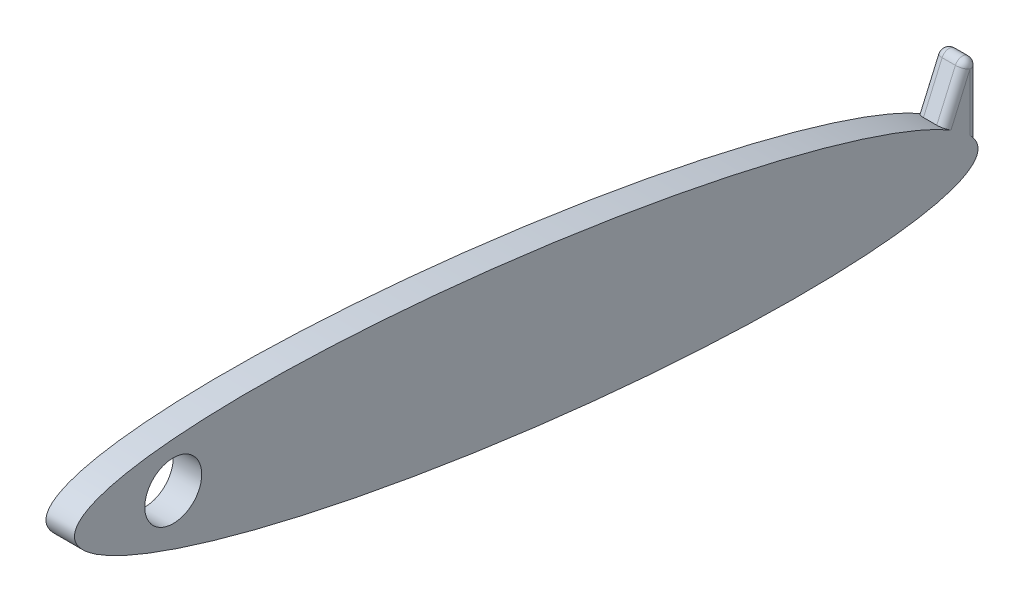
ISO-10303-21;
HEADER;
FILE_DESCRIPTION(('STEP AP214'),'2;1');
FILE_NAME('part.step','',(''),(''),'','','');
FILE_SCHEMA(('AUTOMOTIVE_DESIGN { 1 0 10303 214 1 1 1 1 }'));
ENDSEC;
DATA;
#1=APPLICATION_CONTEXT('core data for automotive mechanical design processes');
#2=APPLICATION_PROTOCOL_DEFINITION('international standard','automotive_design',2000,#1);
#3=PRODUCT_CONTEXT('',#1,'mechanical');
#4=PRODUCT('Part','Part','',(#3));
#5=PRODUCT_RELATED_PRODUCT_CATEGORY('part','',(#4));
#6=PRODUCT_DEFINITION_FORMATION('','',#4);
#7=PRODUCT_DEFINITION_CONTEXT('part definition',#1,'design');
#8=PRODUCT_DEFINITION('design','',#6,#7);
#9=PRODUCT_DEFINITION_SHAPE('','',#8);
#10=(LENGTH_UNIT() NAMED_UNIT(*) SI_UNIT(.MILLI.,.METRE.));
#11=(NAMED_UNIT(*) PLANE_ANGLE_UNIT() SI_UNIT($,.RADIAN.));
#12=(NAMED_UNIT(*) SI_UNIT($,.STERADIAN.) SOLID_ANGLE_UNIT());
#13=UNCERTAINTY_MEASURE_WITH_UNIT(LENGTH_MEASURE(1.E-05),#10,'distance_accuracy_value','');
#14=(GEOMETRIC_REPRESENTATION_CONTEXT(3) GLOBAL_UNCERTAINTY_ASSIGNED_CONTEXT((#13)) GLOBAL_UNIT_ASSIGNED_CONTEXT((#10,
#11,#12)) REPRESENTATION_CONTEXT('',''));
#15=CARTESIAN_POINT('',(0.,0.,0.));
#16=DIRECTION('',(0.,0.,1.));
#17=DIRECTION('',(1.,0.,0.));
#18=AXIS2_PLACEMENT_3D('',#15,#16,#17);
#19=CARTESIAN_POINT('',(4.7625,0.,0.));
#20=DIRECTION('',(1.,0.,0.));
#21=DIRECTION('',(0.,-0.130831963177534,-0.991404557893049));
#22=AXIS2_PLACEMENT_3D('',#19,#20,#21);
#23=ELLIPSE('',#22,76.2,12.7);
#24=DIRECTION('',(-1.,0.,0.));
#25=VECTOR('',#24,1.);
#26=SURFACE_OF_LINEAR_EXTRUSION('',#23,#25);
#27=DIRECTION('',(-1.,0.,0.));
#28=VECTOR('',#27,1.);
#29=CARTESIAN_POINT('',(4.7625,-4.11781313189924,-69.9342520410325));
#30=LINE('',#29,#28);
#31=CARTESIAN_POINT('',(1.27,-4.11781313189926,-69.9342520410325));
#32=VERTEX_POINT('',#31);
#33=CARTESIAN_POINT('',(3.4925,-4.11781313189926,-69.9342520410325));
#34=VERTEX_POINT('',#33);
#35=EDGE_CURVE('E11',#32,#34,#30,.F.);
#36=ORIENTED_EDGE('',*,*,#35,.F.);
#37=CARTESIAN_POINT('',(1.27,-4.11781313189925,-69.9342520410325));
#38=CARTESIAN_POINT('',(1.23437384321973,-4.11781321411353,-69.9342515505505));
#39=CARTESIAN_POINT('',(1.19876349745354,-4.11853075519739,-69.9355751404768));
#40=CARTESIAN_POINT('',(1.12779996880049,-4.12139459719955,-69.9408536288777));
#41=CARTESIAN_POINT('',(1.09244675926415,-4.12354074786129,-69.9448082506288));
#42=CARTESIAN_POINT('',(0.987218928975048,-4.13210341330859,-69.9605759609824));
#43=CARTESIAN_POINT('',(0.918053763795714,-4.14064419127636,-69.9762930214261));
#44=CARTESIAN_POINT('',(0.783681700420832,-4.16320979751784,-70.0176957443832));
#45=CARTESIAN_POINT('',(0.718476635138884,-4.17723714320999,-70.0433859828794));
#46=CARTESIAN_POINT('',(0.625110513491252,-4.20211184031202,-70.0887549558992));
#47=CARTESIAN_POINT('',(0.594725093332998,-4.21104374918917,-70.1050194166951));
#48=CARTESIAN_POINT('',(0.535590867132482,-4.23014462983823,-70.1397249628789));
#49=CARTESIAN_POINT('',(0.506843631821834,-4.24031476049458,-70.1581680868476));
#50=CARTESIAN_POINT('',(0.423389007095394,-4.27259619850998,-70.2165659302266));
#51=CARTESIAN_POINT('',(0.371457756242708,-4.29648146615738,-70.2595944556953));
#52=CARTESIAN_POINT('',(0.276572634470389,-4.34837938169682,-70.3525115707769));
#53=CARTESIAN_POINT('',(0.23361892834492,-4.37639210533743,-70.4024002862895));
#54=CARTESIAN_POINT('',(0.176742434507051,-4.42101549846716,-70.4813154887628));
#55=CARTESIAN_POINT('',(0.159008641523252,-4.43636468579517,-70.5083719775913));
#56=CARTESIAN_POINT('',(0.126225273314743,-4.46781265239265,-70.5636061722054));
#57=CARTESIAN_POINT('',(0.111173310233229,-4.48391074857391,-70.5917828529668));
#58=CARTESIAN_POINT('',(0.0701856415248406,-4.53320189839618,-70.6777276331635));
#59=CARTESIAN_POINT('',(0.0483834064666588,-4.56741910224701,-70.7369588322674));
#60=CARTESIAN_POINT('',(0.0216421648514737,-4.62620681335098,-70.8378730782814));
#61=CARTESIAN_POINT('',(0.0135287623225191,-4.65031350885898,-70.8790282691953));
#62=CARTESIAN_POINT('',(0.00270974934016672,-4.69900739488029,-70.9616806807105));
#63=CARTESIAN_POINT('',(-3.79310603027134E-06,-4.72359382696655,-71.0031773095898));
#64=CARTESIAN_POINT('',(0.,-4.74830563105564,-71.0446325196335));
#65=B_SPLINE_CURVE_WITH_KNOTS('',3,(#37,#38,#39,#40,#41,#42,#43,#44,#45,#46,#47,#48,#49,#50,#51,
#52,#53,#54,#55,#56,#57,#58,#59,#60,#61,#62,#63,#64),.UNSPECIFIED.,.F.,.F.,(4,2,2,2,2,2,2,2,2,2,
2,2,2,4),(0.,0.106815302436601,0.213619372158405,0.426865202597397,0.640208992261775,
0.746908362685685,0.85370837482254,1.06727132696658,1.28083819898389,1.38814673656577,
1.4953592456643,1.70959014910221,1.85445548150351,1.99910785996386),.UNSPECIFIED.);
#66=CARTESIAN_POINT('',(0.,-4.74830563105563,-71.0446325196335));
#67=VERTEX_POINT('',#66);
#68=EDGE_CURVE('E192',#32,#67,#65,.T.);
#69=ORIENTED_EDGE('',*,*,#68,.T.);
#70=CARTESIAN_POINT('',(0.,0.,0.));
#71=DIRECTION('',(1.,0.,0.));
#72=DIRECTION('',(0.,-0.130831963177534,-0.991404557893049));
#73=AXIS2_PLACEMENT_3D('',#70,#71,#72);
#74=ELLIPSE('',#73,76.2,12.7);
#75=CARTESIAN_POINT('',(0.,-7.10592023279893,-74.2122766697926));
#76=VERTEX_POINT('',#75);
#77=EDGE_CURVE('E262',#67,#76,#74,.T.);
#78=ORIENTED_EDGE('',*,*,#77,.T.);
#79=CARTESIAN_POINT('',(0.,-7.10592023279893,-74.2122766697926));
#80=CARTESIAN_POINT('',(7.50140419761714E-06,-7.15927373080229,-74.264980392285));
#81=CARTESIAN_POINT('',(0.00327929272487547,-7.21329875097445,-74.3169506709515));
#82=CARTESIAN_POINT('',(0.0158733544762433,-7.32240303932765,-74.4189362825912));
#83=CARTESIAN_POINT('',(0.0251908264463283,-7.37748143782267,-74.468953132652));
#84=CARTESIAN_POINT('',(0.0494139825498373,-7.48855471286345,-74.5666865783012));
#85=CARTESIAN_POINT('',(0.0643262641561636,-7.54455059647278,-74.6144003828394));
#86=CARTESIAN_POINT('',(0.0993127075720921,-7.65717065797373,-74.7070968032706));
#87=CARTESIAN_POINT('',(0.119387883832298,-7.71379495724736,-74.7520788802603));
#88=CARTESIAN_POINT('',(0.187773013687371,-7.88683595327186,-74.8843463724285));
#89=CARTESIAN_POINT('',(0.243702621491635,-8.00405824337247,-74.9668565189271));
#90=CARTESIAN_POINT('',(0.340548639908684,-8.17957816456171,-75.0791451345942));
#91=CARTESIAN_POINT('',(0.374961213890708,-8.23799259328294,-75.1146414839369));
#92=CARTESIAN_POINT('',(0.447998405111347,-8.3544764004866,-75.1816416252103));
#93=CARTESIAN_POINT('',(0.48662110872695,-8.41254592318673,-75.2131472170905));
#94=CARTESIAN_POINT('',(0.56037209686505,-8.51683264168168,-75.2663081479611));
#95=CARTESIAN_POINT('',(0.594764410811033,-8.56320032093494,-75.2886966085938));
#96=CARTESIAN_POINT('',(0.666643952554579,-8.65498943369255,-75.3305784545331));
#97=CARTESIAN_POINT('',(0.704135532538332,-8.7004094204045,-75.3500676572714));
#98=CARTESIAN_POINT('',(0.763710215359227,-8.7677365041501,-75.377207563354));
#99=CARTESIAN_POINT('',(0.78445241569515,-8.79036828119761,-75.3860172573167));
#100=CARTESIAN_POINT('',(0.827071011519743,-8.83487254171524,-75.4027550346905));
#101=CARTESIAN_POINT('',(0.848947040645549,-8.85674526668324,-75.4106834003044));
#102=CARTESIAN_POINT('',(0.894052765062858,-8.89935670719392,-75.4255893860651));
#103=CARTESIAN_POINT('',(0.917281160818121,-8.92009647545815,-75.4325678981132));
#104=CARTESIAN_POINT('',(0.965439227279079,-8.95983298509324,-75.4454693949697));
#105=CARTESIAN_POINT('',(0.990366414528165,-8.97883217956645,-75.4513938767474));
#106=CARTESIAN_POINT('',(1.03709259386538,-9.01040224512569,-75.46091581109));
#107=CARTESIAN_POINT('',(1.0584872031477,-9.02349284547931,-75.4647413552566));
#108=CARTESIAN_POINT('',(1.10277176887854,-9.04686400958991,-75.4714161062587));
#109=CARTESIAN_POINT('',(1.12565058864431,-9.05716304539023,-75.4742717644448));
#110=CARTESIAN_POINT('',(1.16849546052915,-9.07212891047934,-75.47835937619));
#111=CARTESIAN_POINT('',(1.18818688450664,-9.07749469427076,-75.4797969419865));
#112=CARTESIAN_POINT('',(1.21837751224109,-9.08301414787818,-75.4812680704054));
#113=CARTESIAN_POINT('',(1.22863407569232,-9.08443332372494,-75.4816444210597));
#114=CARTESIAN_POINT('',(1.24925794211331,-9.08634162231588,-75.4821494744886));
#115=CARTESIAN_POINT('',(1.2596254153172,-9.08682901357133,-75.4822777162199));
#116=CARTESIAN_POINT('',(1.27,-9.08682319842322,-75.4822766697926));
#117=B_SPLINE_CURVE_WITH_KNOTS('',3,(#79,#80,#81,#82,#83,#84,#85,#86,#87,#88,#89,#90,#91,#92,
#93,#94,#95,#96,#97,#98,#99,#100,#101,#102,#103,#104,#105,#106,#107,#108,#109,#110,#111,#112,
#113,#114,#115,#116),.UNSPECIFIED.,.F.,.F.,(4,2,2,2,2,2,2,2,2,2,2,2,2,2,2,2,2,2,4),(0.,
0.224852728449587,0.449527209089856,0.674467465820487,0.899451954589364,1.35893773836511,
1.58836611462038,1.81769064062024,2.00332823449195,2.18923109115452,2.28501492564989,
2.38076800110369,2.47643053595976,2.57195610381034,2.64792457668556,2.72337735565965,
2.78446636568308,2.81550781598357,2.8466068932038),.UNSPECIFIED.);
#118=CARTESIAN_POINT('',(1.27,-9.08682319842322,-75.4822766697926));
#119=VERTEX_POINT('',#118);
#120=EDGE_CURVE('E180',#76,#119,#117,.T.);
#121=ORIENTED_EDGE('',*,*,#120,.T.);
#122=DIRECTION('',(-1.,0.,0.));
#123=VECTOR('',#122,1.);
#124=CARTESIAN_POINT('',(4.7625,-9.08682319842319,-75.4822766697926));
#125=LINE('',#124,#123);
#126=CARTESIAN_POINT('',(3.4925,-9.08682319842321,-75.4822766697926));
#127=VERTEX_POINT('',#126);
#128=EDGE_CURVE('E58',#127,#119,#125,.T.);
#129=ORIENTED_EDGE('',*,*,#128,.F.);
#130=CARTESIAN_POINT('',(3.4925,-9.08682319842321,-75.4822766697926));
#131=CARTESIAN_POINT('',(3.50293439429031,-9.0868290842922,-75.4822777404807));
#132=CARTESIAN_POINT('',(3.51336170836689,-9.08633600880533,-75.482148000614));
#133=CARTESIAN_POINT('',(3.53410283417337,-9.08440590394178,-75.4816371487162));
#134=CARTESIAN_POINT('',(3.54441682577582,-9.08297069376447,-75.4812565211268));
#135=CARTESIAN_POINT('',(3.57487789751561,-9.07737047814155,-75.4797637650865));
#136=CARTESIAN_POINT('',(3.59477434912162,-9.07190850519854,-75.4783002958032));
#137=CARTESIAN_POINT('',(3.64241759700809,-9.05514357017737,-75.4737185340595));
#138=CARTESIAN_POINT('',(3.66955975051699,-9.04230906282261,-75.4701485251254));
#139=CARTESIAN_POINT('',(3.72181375008501,-9.01299570739201,-75.4616863470869));
#140=CARTESIAN_POINT('',(3.74690236340807,-8.99648141605644,-75.4567812087747));
#141=CARTESIAN_POINT('',(3.80529040550292,-8.9539806940687,-75.4436557627167));
#142=CARTESIAN_POINT('',(3.8376659609465,-8.92691102207093,-75.4349050774035));
#143=CARTESIAN_POINT('',(3.89980242541339,-8.87045576218819,-75.4156308085587));
#144=CARTESIAN_POINT('',(3.92955749209333,-8.8410652633833,-75.4051034089021));
#145=CARTESIAN_POINT('',(3.98708948557468,-8.78086151274711,-75.3824213458774));
#146=CARTESIAN_POINT('',(4.01486118068527,-8.75004482762221,-75.37026260591));
#147=CARTESIAN_POINT('',(4.06866835337396,-8.68759892804778,-75.3444507424901));
#148=CARTESIAN_POINT('',(4.0947052687553,-8.65597041734342,-75.3307988819811));
#149=CARTESIAN_POINT('',(4.16754870824815,-8.5640905007349,-75.2894054436402));
#150=CARTESIAN_POINT('',(4.21246417857233,-8.50314981037133,-75.2598390264035));
#151=CARTESIAN_POINT('',(4.29755144675329,-8.38040630021949,-75.1959521950238));
#152=CARTESIAN_POINT('',(4.33771937952551,-8.31860282316101,-75.1616279561462));
#153=CARTESIAN_POINT('',(4.41318219016727,-8.19486007212702,-75.088628444688));
#154=CARTESIAN_POINT('',(4.44848922333691,-8.13292154536447,-75.0499644809373));
#155=CARTESIAN_POINT('',(4.51412482853651,-8.00912734359956,-74.9685282120026));
#156=CARTESIAN_POINT('',(4.5444541889538,-7.94727165701884,-74.925756559118));
#157=CARTESIAN_POINT('',(4.60196156191407,-7.81907382463612,-74.8329252668077));
#158=CARTESIAN_POINT('',(4.62870675102968,-7.75275970303055,-74.7825571968698));
#159=CARTESIAN_POINT('',(4.6754550317126,-7.62086755125049,-74.6778960537299));
#160=CARTESIAN_POINT('',(4.69545913041968,-7.55528941253438,-74.6236035683211));
#161=CARTESIAN_POINT('',(4.72816434766953,-7.42489986780297,-74.5113831604227));
#162=CARTESIAN_POINT('',(4.74083386748675,-7.36009294034236,-74.4534406831962));
#163=CARTESIAN_POINT('',(4.75799913834113,-7.23185702569989,-74.334765800367));
#164=CARTESIAN_POINT('',(4.76248656066755,-7.16842950744342,-74.2740306163966));
#165=CARTESIAN_POINT('',(4.7625,-7.10592023279893,-74.2122766697926));
#166=B_SPLINE_CURVE_WITH_KNOTS('',3,(#130,#131,#132,#133,#134,#135,#136,#137,#138,#139,#140,
#141,#142,#143,#144,#145,#146,#147,#148,#149,#150,#151,#152,#153,#154,#155,#156,#157,#158,#159,
#160,#161,#162,#163,#164,#165),.UNSPECIFIED.,.F.,.F.,(4,2,2,2,2,2,2,2,2,2,2,2,2,2,2,2,2,4),(0.,
0.0312784028671975,0.0624965861781544,0.124252856727968,0.214450719649312,0.305558106679854,
0.434550602556132,0.56382376622119,0.693426209344713,0.822919864947825,1.06639543813723,
1.31006788485425,1.55311947825923,1.79613253877667,2.05817742532611,2.32018314418241,
2.58330938962897,2.8467033270142),.UNSPECIFIED.);
#167=CARTESIAN_POINT('',(4.7625,-7.10592023279893,-74.2122766697926));
#168=VERTEX_POINT('',#167);
#169=EDGE_CURVE('E227',#127,#168,#166,.T.);
#170=ORIENTED_EDGE('',*,*,#169,.T.);
#171=CARTESIAN_POINT('',(4.7625,-4.74830563105563,-71.0446325196335));
#172=VERTEX_POINT('',#171);
#173=EDGE_CURVE('E115',#172,#168,#23,.T.);
#174=ORIENTED_EDGE('',*,*,#173,.F.);
#175=CARTESIAN_POINT('',(4.7625,-4.74830563105564,-71.0446325196334));
#176=CARTESIAN_POINT('',(4.76250026370522,-4.72983476985849,-71.0136452531256));
#177=CARTESIAN_POINT('',(4.76098612695112,-4.71143293626195,-70.982634990081));
#178=CARTESIAN_POINT('',(4.75494117938665,-4.67487671648168,-70.9207660260243));
#179=CARTESIAN_POINT('',(4.75041057788073,-4.65672231321861,-70.8899073146462));
#180=CARTESIAN_POINT('',(4.732328588437,-4.60284006097981,-70.7979329688536));
#181=CARTESIAN_POINT('',(4.71428693856118,-4.56764162897864,-70.7373325784644));
#182=CARTESIAN_POINT('',(4.66665542856841,-4.49963608539971,-70.6193549852135));
#183=CARTESIAN_POINT('',(4.63705815657658,-4.46683052469036,-70.5619798781507));
#184=CARTESIAN_POINT('',(4.58467774025388,-4.42010508129493,-70.4797116736317));
#185=CARTESIAN_POINT('',(4.56588519152507,-4.40494273651413,-70.452919536105));
#186=CARTESIAN_POINT('',(4.52574387835999,-4.37551179779901,-70.4007492924126));
#187=CARTESIAN_POINT('',(4.50439264385576,-4.36124408808128,-70.3753725878492));
#188=CARTESIAN_POINT('',(4.43697566606975,-4.32009105887002,-70.3019619449069));
#189=CARTESIAN_POINT('',(4.38733642290419,-4.29466915753928,-70.2563179965092));
#190=CARTESIAN_POINT('',(4.27994600345573,-4.24843405830395,-70.1729251863469));
#191=CARTESIAN_POINT('',(4.22219526462949,-4.22762061201913,-70.1351758990928));
#192=CARTESIAN_POINT('',(4.13091583743046,-4.20027863283626,-70.0854167309458));
#193=CARTESIAN_POINT('',(4.09976838549433,-4.19182165697084,-70.0699940629559));
#194=CARTESIAN_POINT('',(4.03613165905707,-4.17622722672575,-70.0415113981385));
#195=CARTESIAN_POINT('',(4.00364359930587,-4.16908860853988,-70.0284493176764));
#196=CARTESIAN_POINT('',(3.90447217130289,-4.14971261858018,-69.9929528287159));
#197=CARTESIAN_POINT('',(3.83601458806047,-4.13949513072324,-69.9741717056603));
#198=CARTESIAN_POINT('',(3.72135514859744,-4.1273576157871,-69.9518395160651));
#199=CARTESIAN_POINT('',(3.67587773514918,-4.12377973387941,-69.945248824672));
#200=CARTESIAN_POINT('',(3.58444290444411,-4.1190090231529,-69.9364568521875));
#201=CARTESIAN_POINT('',(3.53848627008573,-4.11781277742072,-69.9342492826806));
#202=CARTESIAN_POINT('',(3.4925,-4.11781313189926,-69.9342520410326));
#203=B_SPLINE_CURVE_WITH_KNOTS('',3,(#175,#176,#177,#178,#179,#180,#181,#182,#183,#184,#185,
#186,#187,#188,#189,#190,#191,#192,#193,#194,#195,#196,#197,#198,#199,#200,#201,#202),
.UNSPECIFIED.,.F.,.F.,(4,2,2,2,2,2,2,2,2,2,2,2,2,4),(0.,0.10816107817268,0.216314652118385,
0.432323474476976,0.64847107496015,0.756560611784957,0.864755348108039,1.07986230171388,
1.29495765895491,1.40215618822395,1.50925962875575,1.72323295975606,1.86126314883212,
1.99909516404265),.UNSPECIFIED.);
#204=EDGE_CURVE('E143',#172,#34,#203,.T.);
#205=ORIENTED_EDGE('',*,*,#204,.T.);
#206=EDGE_LOOP('',(#36,#69,#78,#121,#129,#170,#174,#205));
#207=FACE_BOUND('',#206,.T.);
#208=ADVANCED_FACE('F48',(#207),#26,.F.);
#209=CARTESIAN_POINT('',(4.7625,0.,0.));
#210=DIRECTION('',(1.,0.,0.));
#211=DIRECTION('',(0.,0.,-1.));
#212=AXIS2_PLACEMENT_3D('',#209,#210,#211);
#213=PLANE('',#212);
#214=ORIENTED_EDGE('',*,*,#173,.T.);
#215=DIRECTION('',(0.,1.,0.));
#216=VECTOR('',#215,1.);
#217=CARTESIAN_POINT('',(4.7625,8.56247119525711,-74.2122766697926));
#218=LINE('',#217,#216);
#219=CARTESIAN_POINT('',(4.7625,2.49150153617542,-74.2122766697926));
#220=VERTEX_POINT('',#219);
#221=EDGE_CURVE('E108',#168,#220,#218,.T.);
#222=ORIENTED_EDGE('',*,*,#221,.T.);
#223=DIRECTION('',(0.,-0.916146715914514,0.400843105116018));
#224=VECTOR('',#223,1.);
#225=CARTESIAN_POINT('',(4.7625,-9.99165564409872,-68.7505013898392));
#226=LINE('',#225,#224);
#227=EDGE_CURVE('E113',#220,#172,#226,.T.);
#228=ORIENTED_EDGE('',*,*,#227,.T.);
#229=EDGE_LOOP('',(#214,#222,#228));
#230=FACE_BOUND('',#229,.T.);
#231=CARTESIAN_POINT('',(4.7625,8.06590733650121,59.04059174445));
#232=DIRECTION('',(1.,0.,0.));
#233=DIRECTION('',(0.,0.,-1.));
#234=AXIS2_PLACEMENT_3D('',#231,#232,#233);
#235=CIRCLE('',#234,4.7625);
#236=CARTESIAN_POINT('',(4.7625,8.06590733650121,54.27809174445));
#237=VERTEX_POINT('',#236);
#238=EDGE_CURVE('E226',#237,#237,#235,.T.);
#239=ORIENTED_EDGE('',*,*,#238,.F.);
#240=EDGE_LOOP('',(#239));
#241=FACE_BOUND('',#240,.T.);
#242=ADVANCED_FACE('F110',(#230,#241),#213,.T.);
#243=CARTESIAN_POINT('',(0.,0.,0.));
#244=DIRECTION('',(1.,0.,0.));
#245=DIRECTION('',(0.,0.,-1.));
#246=AXIS2_PLACEMENT_3D('',#243,#244,#245);
#247=PLANE('',#246);
#248=ORIENTED_EDGE('',*,*,#77,.F.);
#249=DIRECTION('',(0.,-0.916146715914514,0.400843105116018));
#250=VECTOR('',#249,1.);
#251=CARTESIAN_POINT('',(0.,-26.8527330806138,-61.3732478147852));
#252=LINE('',#251,#250);
#253=CARTESIAN_POINT('',(0.,2.49150153617541,-74.2122766697926));
#254=VERTEX_POINT('',#253);
#255=EDGE_CURVE('E161',#67,#254,#252,.F.);
#256=ORIENTED_EDGE('',*,*,#255,.T.);
#257=DIRECTION('',(0.,1.,0.));
#258=VECTOR('',#257,1.);
#259=CARTESIAN_POINT('',(0.,0.,-74.2122766697926));
#260=LINE('',#259,#258);
#261=EDGE_CURVE('E176',#254,#76,#260,.F.);
#262=ORIENTED_EDGE('',*,*,#261,.T.);
#263=EDGE_LOOP('',(#248,#256,#262));
#264=FACE_BOUND('',#263,.T.);
#265=CARTESIAN_POINT('',(0.,8.06590733650121,59.04059174445));
#266=DIRECTION('',(1.,0.,0.));
#267=DIRECTION('',(0.,0.,-1.));
#268=AXIS2_PLACEMENT_3D('',#265,#266,#267);
#269=CIRCLE('',#268,4.7625);
#270=CARTESIAN_POINT('',(0.,8.06590733650121,54.27809174445));
#271=VERTEX_POINT('',#270);
#272=EDGE_CURVE('E232',#271,#271,#269,.T.);
#273=ORIENTED_EDGE('',*,*,#272,.T.);
#274=EDGE_LOOP('',(#273));
#275=FACE_BOUND('',#274,.T.);
#276=ADVANCED_FACE('F211',(#264,#275),#247,.F.);
#277=CARTESIAN_POINT('',(-1.2E-05,8.06590733650121,59.04059174445));
#278=DIRECTION('',(1.,0.,0.));
#279=DIRECTION('',(0.,0.,-1.));
#280=AXIS2_PLACEMENT_3D('',#277,#278,#279);
#281=CYLINDRICAL_SURFACE('',#280,4.7625);
#282=CARTESIAN_POINT('',(4.7625,8.06590733650121,54.27809174445));
#283=CARTESIAN_POINT('',(4.712890625,8.06590733650121,54.27809174445));
#284=CARTESIAN_POINT('',(4.66328125,8.06590733650121,54.27809174445));
#285=CARTESIAN_POINT('',(4.5640625,8.06590733650121,54.27809174445));
#286=CARTESIAN_POINT('',(4.514453125,8.06590733650121,54.27809174445));
#287=CARTESIAN_POINT('',(4.415234375,8.06590733650121,54.27809174445));
#288=CARTESIAN_POINT('',(4.365625,8.06590733650121,54.27809174445));
#289=CARTESIAN_POINT('',(4.26640625,8.06590733650121,54.27809174445));
#290=CARTESIAN_POINT('',(4.216796875,8.06590733650121,54.27809174445));
#291=CARTESIAN_POINT('',(4.117578125,8.06590733650121,54.27809174445));
#292=CARTESIAN_POINT('',(4.06796875,8.06590733650121,54.27809174445));
#293=CARTESIAN_POINT('',(3.96875,8.06590733650121,54.27809174445));
#294=CARTESIAN_POINT('',(3.919140625,8.06590733650121,54.27809174445));
#295=CARTESIAN_POINT('',(3.819921875,8.06590733650121,54.27809174445));
#296=CARTESIAN_POINT('',(3.7703125,8.06590733650121,54.27809174445));
#297=CARTESIAN_POINT('',(3.67109375,8.06590733650121,54.27809174445));
#298=CARTESIAN_POINT('',(3.621484375,8.06590733650121,54.27809174445));
#299=CARTESIAN_POINT('',(3.522265625,8.06590733650121,54.27809174445));
#300=CARTESIAN_POINT('',(3.47265625,8.06590733650121,54.27809174445));
#301=CARTESIAN_POINT('',(3.3734375,8.06590733650121,54.27809174445));
#302=CARTESIAN_POINT('',(3.323828125,8.06590733650121,54.27809174445));
#303=CARTESIAN_POINT('',(3.224609375,8.06590733650121,54.27809174445));
#304=CARTESIAN_POINT('',(3.175,8.06590733650121,54.27809174445));
#305=CARTESIAN_POINT('',(3.07578125,8.06590733650121,54.27809174445));
#306=CARTESIAN_POINT('',(3.026171875,8.06590733650121,54.27809174445));
#307=CARTESIAN_POINT('',(2.926953125,8.06590733650121,54.27809174445));
#308=CARTESIAN_POINT('',(2.87734375,8.06590733650121,54.27809174445));
#309=CARTESIAN_POINT('',(2.778125,8.06590733650121,54.27809174445));
#310=CARTESIAN_POINT('',(2.728515625,8.06590733650121,54.27809174445));
#311=CARTESIAN_POINT('',(2.629296875,8.06590733650121,54.27809174445));
#312=CARTESIAN_POINT('',(2.5796875,8.06590733650121,54.27809174445));
#313=CARTESIAN_POINT('',(2.48046875,8.06590733650121,54.27809174445));
#314=CARTESIAN_POINT('',(2.430859375,8.06590733650121,54.27809174445));
#315=CARTESIAN_POINT('',(2.331640625,8.06590733650121,54.27809174445));
#316=CARTESIAN_POINT('',(2.28203125,8.06590733650121,54.27809174445));
#317=CARTESIAN_POINT('',(2.1828125,8.06590733650121,54.27809174445));
#318=CARTESIAN_POINT('',(2.133203125,8.06590733650121,54.27809174445));
#319=CARTESIAN_POINT('',(2.033984375,8.06590733650121,54.27809174445));
#320=CARTESIAN_POINT('',(1.984375,8.06590733650121,54.27809174445));
#321=CARTESIAN_POINT('',(1.88515625,8.06590733650121,54.27809174445));
#322=CARTESIAN_POINT('',(1.835546875,8.06590733650121,54.27809174445));
#323=CARTESIAN_POINT('',(1.736328125,8.06590733650121,54.27809174445));
#324=CARTESIAN_POINT('',(1.68671875,8.06590733650121,54.27809174445));
#325=CARTESIAN_POINT('',(1.5875,8.06590733650121,54.27809174445));
#326=CARTESIAN_POINT('',(1.537890625,8.06590733650121,54.27809174445));
#327=CARTESIAN_POINT('',(1.438671875,8.06590733650121,54.27809174445));
#328=CARTESIAN_POINT('',(1.3890625,8.06590733650121,54.27809174445));
#329=CARTESIAN_POINT('',(1.28984375,8.06590733650121,54.27809174445));
#330=CARTESIAN_POINT('',(1.240234375,8.06590733650121,54.27809174445));
#331=CARTESIAN_POINT('',(1.141015625,8.06590733650121,54.27809174445));
#332=CARTESIAN_POINT('',(1.09140625,8.06590733650121,54.27809174445));
#333=CARTESIAN_POINT('',(0.9921875,8.06590733650121,54.27809174445));
#334=CARTESIAN_POINT('',(0.942578125,8.06590733650121,54.27809174445));
#335=CARTESIAN_POINT('',(0.843359375,8.06590733650121,54.27809174445));
#336=CARTESIAN_POINT('',(0.79375,8.06590733650121,54.27809174445));
#337=CARTESIAN_POINT('',(0.69453125,8.06590733650121,54.27809174445));
#338=CARTESIAN_POINT('',(0.644921875,8.06590733650121,54.27809174445));
#339=CARTESIAN_POINT('',(0.545703125,8.06590733650121,54.27809174445));
#340=CARTESIAN_POINT('',(0.49609375,8.06590733650121,54.27809174445));
#341=CARTESIAN_POINT('',(0.396875,8.06590733650121,54.27809174445));
#342=CARTESIAN_POINT('',(0.347265625,8.06590733650121,54.27809174445));
#343=CARTESIAN_POINT('',(0.248046875,8.06590733650121,54.27809174445));
#344=CARTESIAN_POINT('',(0.1984375,8.06590733650121,54.27809174445));
#345=CARTESIAN_POINT('',(0.0992187499999998,8.06590733650121,54.27809174445));
#346=CARTESIAN_POINT('',(0.0496093749999998,8.06590733650121,54.27809174445));
#347=CARTESIAN_POINT('',(0.,8.06590733650121,54.27809174445));
#348=B_SPLINE_CURVE_WITH_KNOTS('',3,(#282,#283,#284,#285,#286,#287,#288,#289,#290,#291,#292,
#293,#294,#295,#296,#297,#298,#299,#300,#301,#302,#303,#304,#305,#306,#307,#308,#309,#310,#311,
#312,#313,#314,#315,#316,#317,#318,#319,#320,#321,#322,#323,#324,#325,#326,#327,#328,#329,#330,
#331,#332,#333,#334,#335,#336,#337,#338,#339,#340,#341,#342,#343,#344,#345,#346,#347),
.UNSPECIFIED.,.F.,.F.,(4,2,2,2,2,2,2,2,2,2,2,2,2,2,2,2,2,2,2,2,2,2,2,2,2,2,2,2,2,2,2,2,4),(0.,
0.148828125,0.29765625,0.446484375,0.5953125,0.744140625,0.89296875,1.041796875,1.190625,
1.339453125,1.48828125,1.637109375,1.7859375,1.934765625,2.08359375,2.232421875,2.38125,
2.530078125,2.67890625,2.827734375,2.9765625,3.125390625,3.27421875,3.423046875,3.571875,
3.720703125,3.86953125,4.018359375,4.1671875,4.316015625,4.46484375,4.613671875,4.7625),.UNSPECIFIED.);
#349=EDGE_CURVE('BSEAM207',#237,#271,#348,.T.);
#350=ORIENTED_EDGE('',*,*,#238,.T.);
#351=ORIENTED_EDGE('',*,*,#272,.F.);
#352=ORIENTED_EDGE('',*,*,#349,.T.);
#353=ORIENTED_EDGE('',*,*,#349,.F.);
#354=EDGE_LOOP('',(#350,#352,#351,#353));
#355=FACE_BOUND('',#354,.T.);
#356=ADVANCED_FACE('F207',(#355),#281,.F.);
#357=CARTESIAN_POINT('',(4.7625,8.56247119525711,-75.4822766697926));
#358=DIRECTION('',(0.,-0.400843105116018,-0.916146715914514));
#359=DIRECTION('',(0.,0.916146715914514,-0.400843105116018));
#360=AXIS2_PLACEMENT_3D('',#357,#358,#359);
#361=PLANE('',#360);
#362=DIRECTION('',(0.,-0.916146715914514,0.400843105116018));
#363=VECTOR('',#362,1.);
#364=CARTESIAN_POINT('',(1.27,8.56247119525711,-75.4822766697926));
#365=LINE('',#364,#363);
#366=CARTESIAN_POINT('',(1.27,3.00057227967279,-73.0487703405811));
#367=VERTEX_POINT('',#366);
#368=EDGE_CURVE('E158',#367,#32,#365,.T.);
#369=ORIENTED_EDGE('',*,*,#368,.T.);
#370=ORIENTED_EDGE('',*,*,#35,.T.);
#371=DIRECTION('',(0.,-0.916146715914514,0.400843105116018));
#372=VECTOR('',#371,1.);
#373=CARTESIAN_POINT('',(3.4925,8.56247119525712,-75.4822766697926));
#374=LINE('',#373,#372);
#375=CARTESIAN_POINT('',(3.4925,3.00057227967279,-73.0487703405811));
#376=VERTEX_POINT('',#375);
#377=EDGE_CURVE('E151',#34,#376,#374,.F.);
#378=ORIENTED_EDGE('',*,*,#377,.T.);
#379=DIRECTION('',(-1.,0.,0.));
#380=VECTOR('',#379,1.);
#381=CARTESIAN_POINT('',(4.7625,3.00057227967279,-73.0487703405811));
#382=LINE('',#381,#380);
#383=EDGE_CURVE('E154',#376,#367,#382,.T.);
#384=ORIENTED_EDGE('',*,*,#383,.T.);
#385=EDGE_LOOP('',(#369,#370,#378,#384));
#386=FACE_BOUND('',#385,.T.);
#387=ADVANCED_FACE('F210',(#386),#361,.F.);
#388=CARTESIAN_POINT('',(4.7625,-9.48258490060138,-75.4822766697926));
#389=DIRECTION('',(0.,0.,1.));
#390=DIRECTION('',(1.,0.,0.));
#391=AXIS2_PLACEMENT_3D('',#388,#389,#390);
#392=PLANE('',#391);
#393=DIRECTION('',(0.,1.,0.));
#394=VECTOR('',#393,1.);
#395=CARTESIAN_POINT('',(3.4925,-9.48258490060138,-75.4822766697926));
#396=LINE('',#395,#394);
#397=CARTESIAN_POINT('',(3.4925,2.49150153617545,-75.4822766697926));
#398=VERTEX_POINT('',#397);
#399=EDGE_CURVE('E127',#398,#127,#396,.F.);
#400=ORIENTED_EDGE('',*,*,#399,.T.);
#401=ORIENTED_EDGE('',*,*,#128,.T.);
#402=DIRECTION('',(0.,1.,0.));
#403=VECTOR('',#402,1.);
#404=CARTESIAN_POINT('',(1.27,-9.48258490060138,-75.4822766697926));
#405=LINE('',#404,#403);
#406=CARTESIAN_POINT('',(1.27,2.49150153617545,-75.4822766697926));
#407=VERTEX_POINT('',#406);
#408=EDGE_CURVE('E65',#119,#407,#405,.T.);
#409=ORIENTED_EDGE('',*,*,#408,.T.);
#410=DIRECTION('',(-1.,0.,0.));
#411=VECTOR('',#410,1.);
#412=CARTESIAN_POINT('',(4.7625,2.49150153617545,-75.4822766697926));
#413=LINE('',#412,#411);
#414=EDGE_CURVE('E119',#407,#398,#413,.F.);
#415=ORIENTED_EDGE('',*,*,#414,.T.);
#416=EDGE_LOOP('',(#400,#401,#409,#415));
#417=FACE_BOUND('',#416,.T.);
#418=ADVANCED_FACE('F247',(#417),#392,.F.);
#419=CARTESIAN_POINT('',(3.4925,-26.8527330806138,-61.3732478147852));
#420=DIRECTION('',(0.,0.916146715914514,-0.400843105116018));
#421=DIRECTION('',(0.,0.400843105116018,0.916146715914514));
#422=AXIS2_PLACEMENT_3D('',#419,#420,#421);
#423=CYLINDRICAL_SURFACE('',#422,1.27);
#424=ORIENTED_EDGE('',*,*,#204,.F.);
#425=ORIENTED_EDGE('',*,*,#227,.F.);
#426=CARTESIAN_POINT('',(3.4925,2.49150153617545,-74.2122766697926));
#427=DIRECTION('',(0.,0.916146715914514,-0.400843105116018));
#428=DIRECTION('',(0.,0.400843105116018,0.916146715914514));
#429=AXIS2_PLACEMENT_3D('',#426,#427,#428);
#430=CIRCLE('',#429,1.27);
#431=EDGE_CURVE('E135',#376,#220,#430,.T.);
#432=ORIENTED_EDGE('',*,*,#431,.F.);
#433=ORIENTED_EDGE('',*,*,#377,.F.);
#434=EDGE_LOOP('',(#424,#425,#432,#433));
#435=FACE_BOUND('',#434,.T.);
#436=ADVANCED_FACE('F141',(#435),#423,.T.);
#437=CARTESIAN_POINT('',(3.4925,0.,-74.2122766697926));
#438=DIRECTION('',(0.,-1.,0.));
#439=DIRECTION('',(0.,0.,-1.));
#440=AXIS2_PLACEMENT_3D('',#437,#438,#439);
#441=CYLINDRICAL_SURFACE('',#440,1.27);
#442=ORIENTED_EDGE('',*,*,#169,.F.);
#443=ORIENTED_EDGE('',*,*,#399,.F.);
#444=CARTESIAN_POINT('',(3.4925,2.49150153617542,-74.2122766697926));
#445=DIRECTION('',(0.,1.,0.));
#446=DIRECTION('',(0.,0.,1.));
#447=AXIS2_PLACEMENT_3D('',#444,#445,#446);
#448=CIRCLE('',#447,1.27);
#449=EDGE_CURVE('E123',#398,#220,#448,.F.);
#450=ORIENTED_EDGE('',*,*,#449,.T.);
#451=ORIENTED_EDGE('',*,*,#221,.F.);
#452=EDGE_LOOP('',(#442,#443,#450,#451));
#453=FACE_BOUND('',#452,.T.);
#454=ADVANCED_FACE('F125',(#453),#441,.T.);
#455=CARTESIAN_POINT('',(1.27,8.05340045175977,-76.645782999004));
#456=DIRECTION('',(0.,-0.916146715914514,0.400843105116018));
#457=DIRECTION('',(0.,-0.400843105116018,-0.916146715914514));
#458=AXIS2_PLACEMENT_3D('',#455,#456,#457);
#459=CYLINDRICAL_SURFACE('',#458,1.27);
#460=ORIENTED_EDGE('',*,*,#68,.F.);
#461=ORIENTED_EDGE('',*,*,#368,.F.);
#462=CARTESIAN_POINT('',(1.27,2.49150153617545,-74.2122766697926));
#463=DIRECTION('',(0.,-0.916146715914514,0.400843105116018));
#464=DIRECTION('',(0.,-0.400843105116018,-0.916146715914514));
#465=AXIS2_PLACEMENT_3D('',#462,#463,#464);
#466=CIRCLE('',#465,1.27);
#467=EDGE_CURVE('E170',#367,#254,#466,.T.);
#468=ORIENTED_EDGE('',*,*,#467,.T.);
#469=ORIENTED_EDGE('',*,*,#255,.F.);
#470=EDGE_LOOP('',(#460,#461,#468,#469));
#471=FACE_BOUND('',#470,.T.);
#472=ADVANCED_FACE('F205',(#471),#459,.T.);
#473=CARTESIAN_POINT('',(1.27,-9.48258490060138,-74.2122766697926));
#474=DIRECTION('',(0.,1.,0.));
#475=DIRECTION('',(0.,0.,1.));
#476=AXIS2_PLACEMENT_3D('',#473,#474,#475);
#477=CYLINDRICAL_SURFACE('',#476,1.27);
#478=ORIENTED_EDGE('',*,*,#120,.F.);
#479=ORIENTED_EDGE('',*,*,#261,.F.);
#480=CARTESIAN_POINT('',(1.27,2.49150153617545,-74.2122766697926));
#481=DIRECTION('',(0.,1.,0.));
#482=DIRECTION('',(0.,0.,1.));
#483=AXIS2_PLACEMENT_3D('',#480,#481,#482);
#484=CIRCLE('',#483,1.27);
#485=EDGE_CURVE('E132',#407,#254,#484,.T.);
#486=ORIENTED_EDGE('',*,*,#485,.F.);
#487=ORIENTED_EDGE('',*,*,#408,.F.);
#488=EDGE_LOOP('',(#478,#479,#486,#487));
#489=FACE_BOUND('',#488,.T.);
#490=ADVANCED_FACE('F199',(#489),#477,.T.);
#491=CARTESIAN_POINT('',(4.7625,2.49150153617545,-74.2122766697926));
#492=DIRECTION('',(-1.,0.,0.));
#493=DIRECTION('',(0.,0.,1.));
#494=AXIS2_PLACEMENT_3D('',#491,#492,#493);
#495=CYLINDRICAL_SURFACE('',#494,1.27);
#496=ORIENTED_EDGE('',*,*,#414,.F.);
#497=CARTESIAN_POINT('',(1.27,2.49150153617545,-74.2122766697926));
#498=DIRECTION('',(-1.,0.,0.));
#499=DIRECTION('',(0.,0.,1.));
#500=AXIS2_PLACEMENT_3D('',#497,#498,#499);
#501=CIRCLE('',#500,1.27);
#502=EDGE_CURVE('E163',#407,#367,#501,.F.);
#503=ORIENTED_EDGE('',*,*,#502,.T.);
#504=ORIENTED_EDGE('',*,*,#383,.F.);
#505=CARTESIAN_POINT('',(3.4925,2.49150153617545,-74.2122766697926));
#506=DIRECTION('',(1.,0.,0.));
#507=DIRECTION('',(0.,0.,-1.));
#508=AXIS2_PLACEMENT_3D('',#505,#506,#507);
#509=CIRCLE('',#508,1.27);
#510=EDGE_CURVE('E131',#398,#376,#509,.T.);
#511=ORIENTED_EDGE('',*,*,#510,.F.);
#512=EDGE_LOOP('',(#496,#503,#504,#511));
#513=FACE_BOUND('',#512,.T.);
#514=ADVANCED_FACE('F204',(#513),#495,.T.);
#515=CARTESIAN_POINT('',(3.4925,2.49150153617545,-74.2122766697926));
#516=DIRECTION('',(1.,0.,0.));
#517=DIRECTION('',(0.,1.,0.));
#518=AXIS2_PLACEMENT_3D('',#515,#516,#517);
#519=SPHERICAL_SURFACE('',#518,1.27);
#520=ORIENTED_EDGE('',*,*,#510,.T.);
#521=ORIENTED_EDGE('',*,*,#431,.T.);
#522=ORIENTED_EDGE('',*,*,#449,.F.);
#523=EDGE_LOOP('',(#520,#521,#522));
#524=FACE_BOUND('',#523,.T.);
#525=ADVANCED_FACE('F136',(#524),#519,.T.);
#526=CARTESIAN_POINT('',(1.27,2.49150153617545,-74.2122766697926));
#527=DIRECTION('',(0.,0.,1.));
#528=DIRECTION('',(1.,0.,0.));
#529=AXIS2_PLACEMENT_3D('',#526,#527,#528);
#530=SPHERICAL_SURFACE('',#529,1.27);
#531=ORIENTED_EDGE('',*,*,#485,.T.);
#532=ORIENTED_EDGE('',*,*,#467,.F.);
#533=ORIENTED_EDGE('',*,*,#502,.F.);
#534=EDGE_LOOP('',(#531,#532,#533));
#535=FACE_BOUND('',#534,.T.);
#536=ADVANCED_FACE('F206',(#535),#530,.T.);
#537=CLOSED_SHELL('',(#208,#242,#276,#356,#387,#418,#436,#454,#472,#490,#514,#525,#536));
#538=MANIFOLD_SOLID_BREP('B2',#537);
#539=ADVANCED_BREP_SHAPE_REPRESENTATION('',(#18,#538),#14);
#540=SHAPE_DEFINITION_REPRESENTATION(#9,#539);
ENDSEC;
END-ISO-10303-21;
